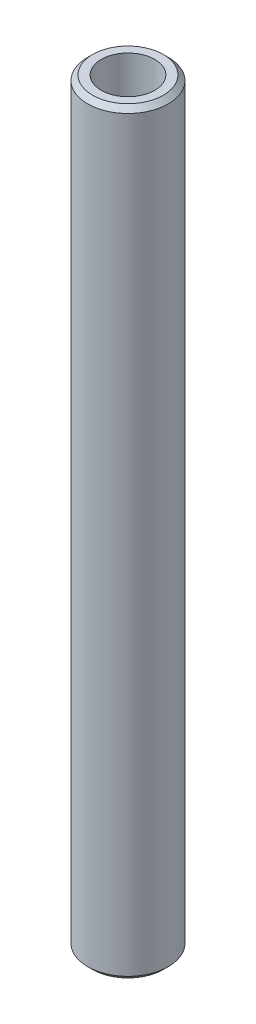
ISO-10303-21;
HEADER;
FILE_DESCRIPTION(('STEP AP214'),'2;1');
FILE_NAME('part.step','',(''),(''),'','','');
FILE_SCHEMA(('AUTOMOTIVE_DESIGN { 1 0 10303 214 1 1 1 1 }'));
ENDSEC;
DATA;
#1=APPLICATION_CONTEXT('core data for automotive mechanical design processes');
#2=APPLICATION_PROTOCOL_DEFINITION('international standard','automotive_design',2000,#1);
#3=PRODUCT_CONTEXT('',#1,'mechanical');
#4=PRODUCT('Part','Part','',(#3));
#5=PRODUCT_RELATED_PRODUCT_CATEGORY('part','',(#4));
#6=PRODUCT_DEFINITION_FORMATION('','',#4);
#7=PRODUCT_DEFINITION_CONTEXT('part definition',#1,'design');
#8=PRODUCT_DEFINITION('design','',#6,#7);
#9=PRODUCT_DEFINITION_SHAPE('','',#8);
#10=(LENGTH_UNIT() NAMED_UNIT(*) SI_UNIT(.MILLI.,.METRE.));
#11=(NAMED_UNIT(*) PLANE_ANGLE_UNIT() SI_UNIT($,.RADIAN.));
#12=(NAMED_UNIT(*) SI_UNIT($,.STERADIAN.) SOLID_ANGLE_UNIT());
#13=UNCERTAINTY_MEASURE_WITH_UNIT(LENGTH_MEASURE(1.E-05),#10,'distance_accuracy_value','');
#14=(GEOMETRIC_REPRESENTATION_CONTEXT(3) GLOBAL_UNCERTAINTY_ASSIGNED_CONTEXT((#13)) GLOBAL_UNIT_ASSIGNED_CONTEXT((#10,
#11,#12)) REPRESENTATION_CONTEXT('',''));
#15=CARTESIAN_POINT('',(0.,0.,0.));
#16=DIRECTION('',(0.,0.,1.));
#17=DIRECTION('',(1.,0.,0.));
#18=AXIS2_PLACEMENT_3D('',#15,#16,#17);
#19=CARTESIAN_POINT('',(0.,234.681950535445,0.));
#20=DIRECTION('',(0.,-1.,0.));
#21=DIRECTION('',(0.,0.,-1.));
#22=AXIS2_PLACEMENT_3D('',#19,#20,#21);
#23=CYLINDRICAL_SURFACE('',#22,12.5);
#24=CARTESIAN_POINT('',(0.,233.1392994918,0.));
#25=DIRECTION('',(0.,1.,0.));
#26=DIRECTION('',(0.,0.,1.));
#27=AXIS2_PLACEMENT_3D('',#24,#25,#26);
#28=CIRCLE('',#27,12.5);
#29=CARTESIAN_POINT('',(0.,233.1392994918,12.5));
#30=VERTEX_POINT('',#29);
#31=EDGE_CURVE('E50',#30,#30,#28,.F.);
#32=ORIENTED_EDGE('',*,*,#31,.T.);
#33=EDGE_LOOP('',(#32));
#34=FACE_BOUND('',#33,.T.);
#35=CARTESIAN_POINT('',(0.,1.54265104364593,0.));
#36=DIRECTION('',(0.,1.,0.));
#37=DIRECTION('',(0.,0.,1.));
#38=AXIS2_PLACEMENT_3D('',#35,#36,#37);
#39=CIRCLE('',#38,12.5);
#40=CARTESIAN_POINT('',(0.,1.54265104364593,12.5));
#41=VERTEX_POINT('',#40);
#42=EDGE_CURVE('E51',#41,#41,#39,.T.);
#43=ORIENTED_EDGE('',*,*,#42,.T.);
#44=EDGE_LOOP('',(#43));
#45=FACE_BOUND('',#44,.T.);
#46=ADVANCED_FACE('F39',(#34,#45),#23,.T.);
#47=CARTESIAN_POINT('',(0.,234.681950535445,0.));
#48=DIRECTION('',(0.,1.,0.));
#49=DIRECTION('',(0.,0.,1.));
#50=AXIS2_PLACEMENT_3D('',#47,#48,#49);
#51=PLANE('',#50);
#52=CARTESIAN_POINT('',(0.,234.681950535445,0.));
#53=DIRECTION('',(0.,1.,0.));
#54=DIRECTION('',(0.,0.,1.));
#55=AXIS2_PLACEMENT_3D('',#52,#53,#54);
#56=CIRCLE('',#55,10.9573489563541);
#57=CARTESIAN_POINT('',(0.,234.681950535445,10.9573489563541));
#58=VERTEX_POINT('',#57);
#59=EDGE_CURVE('E54',#58,#58,#56,.T.);
#60=ORIENTED_EDGE('',*,*,#59,.T.);
#61=EDGE_LOOP('',(#60));
#62=FACE_BOUND('',#61,.T.);
#63=CARTESIAN_POINT('',(0.,234.681950535445,0.));
#64=DIRECTION('',(0.,1.,0.));
#65=DIRECTION('',(0.,0.,1.));
#66=AXIS2_PLACEMENT_3D('',#63,#64,#65);
#67=CIRCLE('',#66,8.30872188751968);
#68=CARTESIAN_POINT('',(0.,234.681950535445,8.30872188751968));
#69=VERTEX_POINT('',#68);
#70=EDGE_CURVE('E58',#69,#69,#67,.T.);
#71=ORIENTED_EDGE('',*,*,#70,.F.);
#72=EDGE_LOOP('',(#71));
#73=FACE_BOUND('',#72,.T.);
#74=ADVANCED_FACE('F69',(#62,#73),#51,.T.);
#75=CARTESIAN_POINT('',(0.,0.,0.));
#76=DIRECTION('',(0.,1.,0.));
#77=DIRECTION('',(0.,0.,1.));
#78=AXIS2_PLACEMENT_3D('',#75,#76,#77);
#79=PLANE('',#78);
#80=CARTESIAN_POINT('',(0.,0.,0.));
#81=DIRECTION('',(0.,1.,0.));
#82=DIRECTION('',(0.,0.,1.));
#83=AXIS2_PLACEMENT_3D('',#80,#81,#82);
#84=CIRCLE('',#83,10.9573489563541);
#85=CARTESIAN_POINT('',(0.,0.,10.9573489563541));
#86=VERTEX_POINT('',#85);
#87=EDGE_CURVE('E10',#86,#86,#84,.F.);
#88=ORIENTED_EDGE('',*,*,#87,.T.);
#89=EDGE_LOOP('',(#88));
#90=FACE_BOUND('',#89,.T.);
#91=CARTESIAN_POINT('',(0.,0.,0.));
#92=DIRECTION('',(0.,1.,0.));
#93=DIRECTION('',(0.,0.,1.));
#94=AXIS2_PLACEMENT_3D('',#91,#92,#93);
#95=CIRCLE('',#94,8.30872188751968);
#96=CARTESIAN_POINT('',(0.,0.,8.30872188751968));
#97=VERTEX_POINT('',#96);
#98=EDGE_CURVE('E63',#97,#97,#95,.T.);
#99=ORIENTED_EDGE('',*,*,#98,.T.);
#100=EDGE_LOOP('',(#99));
#101=FACE_BOUND('',#100,.T.);
#102=ADVANCED_FACE('F75',(#90,#101),#79,.F.);
#103=CARTESIAN_POINT('',(0.,234.681950535445,0.));
#104=DIRECTION('',(0.,-1.,0.));
#105=DIRECTION('',(0.,0.,-1.));
#106=AXIS2_PLACEMENT_3D('',#103,#104,#105);
#107=CYLINDRICAL_SURFACE('',#106,8.30872188751968);
#108=ORIENTED_EDGE('',*,*,#70,.T.);
#109=EDGE_LOOP('',(#108));
#110=FACE_BOUND('',#109,.T.);
#111=ORIENTED_EDGE('',*,*,#98,.F.);
#112=EDGE_LOOP('',(#111));
#113=FACE_BOUND('',#112,.T.);
#114=ADVANCED_FACE('F70',(#110,#113),#107,.F.);
#115=CARTESIAN_POINT('',(0.,234.681950535445,0.));
#116=DIRECTION('',(0.,-1.,0.));
#117=DIRECTION('',(0.,0.,-1.));
#118=AXIS2_PLACEMENT_3D('',#115,#116,#117);
#119=CONICAL_SURFACE('',#118,10.9573489563541,0.785398163397436);
#120=ORIENTED_EDGE('',*,*,#31,.F.);
#121=EDGE_LOOP('',(#120));
#122=FACE_BOUND('',#121,.T.);
#123=ORIENTED_EDGE('',*,*,#59,.F.);
#124=EDGE_LOOP('',(#123));
#125=FACE_BOUND('',#124,.T.);
#126=ADVANCED_FACE('F81',(#122,#125),#119,.T.);
#127=CARTESIAN_POINT('',(0.,1.54265104364593,0.));
#128=DIRECTION('',(0.,1.,0.));
#129=DIRECTION('',(0.,0.,1.));
#130=AXIS2_PLACEMENT_3D('',#127,#128,#129);
#131=CONICAL_SURFACE('',#130,12.5,0.785398163397444);
#132=ORIENTED_EDGE('',*,*,#87,.F.);
#133=EDGE_LOOP('',(#132));
#134=FACE_BOUND('',#133,.T.);
#135=ORIENTED_EDGE('',*,*,#42,.F.);
#136=EDGE_LOOP('',(#135));
#137=FACE_BOUND('',#136,.T.);
#138=ADVANCED_FACE('F45',(#134,#137),#131,.T.);
#139=CLOSED_SHELL('',(#46,#74,#102,#114,#126,#138));
#140=MANIFOLD_SOLID_BREP('B2',#139);
#141=ADVANCED_BREP_SHAPE_REPRESENTATION('',(#18,#140),#14);
#142=SHAPE_DEFINITION_REPRESENTATION(#9,#141);
ENDSEC;
END-ISO-10303-21;
